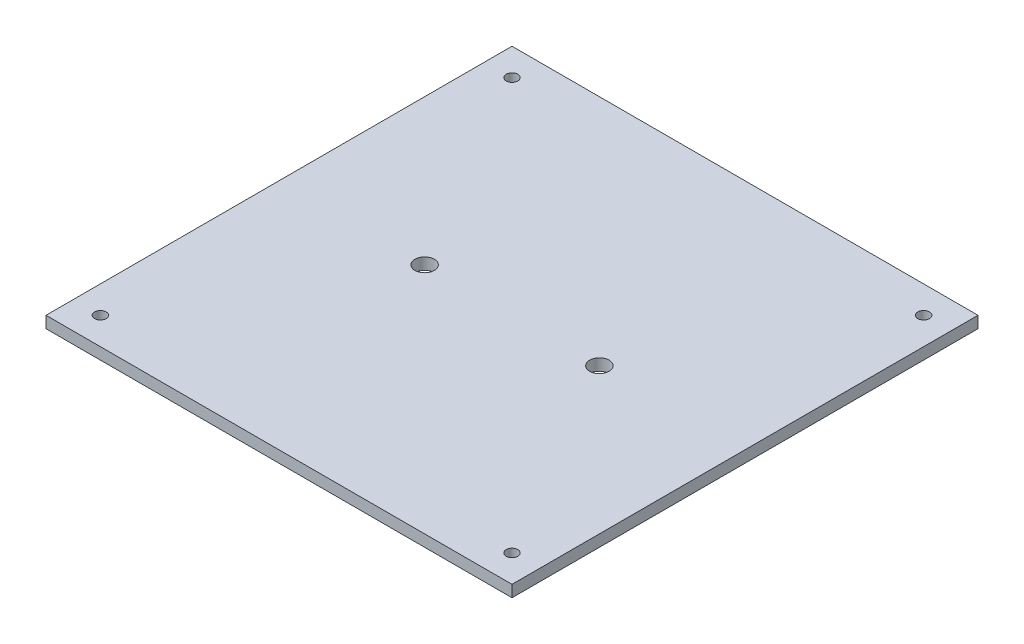
ISO-10303-21;
HEADER;
FILE_DESCRIPTION(('STEP AP214'),'2;1');
FILE_NAME('part.step','',(''),(''),'','','');
FILE_SCHEMA(('AUTOMOTIVE_DESIGN { 1 0 10303 214 1 1 1 1 }'));
ENDSEC;
DATA;
#1=APPLICATION_CONTEXT('core data for automotive mechanical design processes');
#2=APPLICATION_PROTOCOL_DEFINITION('international standard','automotive_design',2000,#1);
#3=PRODUCT_CONTEXT('',#1,'mechanical');
#4=PRODUCT('Part','Part','',(#3));
#5=PRODUCT_RELATED_PRODUCT_CATEGORY('part','',(#4));
#6=PRODUCT_DEFINITION_FORMATION('','',#4);
#7=PRODUCT_DEFINITION_CONTEXT('part definition',#1,'design');
#8=PRODUCT_DEFINITION('design','',#6,#7);
#9=PRODUCT_DEFINITION_SHAPE('','',#8);
#10=(LENGTH_UNIT() NAMED_UNIT(*) SI_UNIT(.MILLI.,.METRE.));
#11=(NAMED_UNIT(*) PLANE_ANGLE_UNIT() SI_UNIT($,.RADIAN.));
#12=(NAMED_UNIT(*) SI_UNIT($,.STERADIAN.) SOLID_ANGLE_UNIT());
#13=UNCERTAINTY_MEASURE_WITH_UNIT(LENGTH_MEASURE(1.E-05),#10,'distance_accuracy_value','');
#14=(GEOMETRIC_REPRESENTATION_CONTEXT(3) GLOBAL_UNCERTAINTY_ASSIGNED_CONTEXT((#13)) GLOBAL_UNIT_ASSIGNED_CONTEXT((#10,
#11,#12)) REPRESENTATION_CONTEXT('',''));
#15=CARTESIAN_POINT('',(0.,0.,0.));
#16=DIRECTION('',(0.,0.,1.));
#17=DIRECTION('',(1.,0.,0.));
#18=AXIS2_PLACEMENT_3D('',#15,#16,#17);
#19=CARTESIAN_POINT('',(60.,3.,60.));
#20=DIRECTION('',(-1.,0.,0.));
#21=DIRECTION('',(0.,0.,1.));
#22=AXIS2_PLACEMENT_3D('',#19,#20,#21);
#23=PLANE('',#22);
#24=DIRECTION('',(0.,0.,-1.));
#25=VECTOR('',#24,1.);
#26=CARTESIAN_POINT('',(60.,0.,60.));
#27=LINE('',#26,#25);
#28=CARTESIAN_POINT('',(60.,0.,60.));
#29=VERTEX_POINT('',#28);
#30=CARTESIAN_POINT('',(60.,0.,-60.));
#31=VERTEX_POINT('',#30);
#32=EDGE_CURVE('E96',#29,#31,#27,.T.);
#33=ORIENTED_EDGE('',*,*,#32,.T.);
#34=DIRECTION('',(0.,-1.,0.));
#35=VECTOR('',#34,1.);
#36=CARTESIAN_POINT('',(60.,3.,-60.));
#37=LINE('',#36,#35);
#38=CARTESIAN_POINT('',(60.,3.,-60.));
#39=VERTEX_POINT('',#38);
#40=EDGE_CURVE('E11',#39,#31,#37,.T.);
#41=ORIENTED_EDGE('',*,*,#40,.F.);
#42=DIRECTION('',(0.,0.,-1.));
#43=VECTOR('',#42,1.);
#44=CARTESIAN_POINT('',(60.,3.,60.));
#45=LINE('',#44,#43);
#46=CARTESIAN_POINT('',(60.,3.,60.));
#47=VERTEX_POINT('',#46);
#48=EDGE_CURVE('E84',#47,#39,#45,.T.);
#49=ORIENTED_EDGE('',*,*,#48,.F.);
#50=DIRECTION('',(0.,-1.,0.));
#51=VECTOR('',#50,1.);
#52=CARTESIAN_POINT('',(60.,3.,60.));
#53=LINE('',#52,#51);
#54=EDGE_CURVE('E92',#47,#29,#53,.T.);
#55=ORIENTED_EDGE('',*,*,#54,.T.);
#56=EDGE_LOOP('',(#33,#41,#49,#55));
#57=FACE_BOUND('',#56,.T.);
#58=ADVANCED_FACE('F33',(#57),#23,.F.);
#59=CARTESIAN_POINT('',(-60.,3.,-60.));
#60=DIRECTION('',(0.,0.,1.));
#61=DIRECTION('',(1.,0.,0.));
#62=AXIS2_PLACEMENT_3D('',#59,#60,#61);
#63=PLANE('',#62);
#64=DIRECTION('',(-1.,0.,0.));
#65=VECTOR('',#64,1.);
#66=CARTESIAN_POINT('',(-60.,0.,-60.));
#67=LINE('',#66,#65);
#68=CARTESIAN_POINT('',(-60.,0.,-60.));
#69=VERTEX_POINT('',#68);
#70=EDGE_CURVE('E88',#31,#69,#67,.T.);
#71=ORIENTED_EDGE('',*,*,#70,.T.);
#72=DIRECTION('',(0.,-1.,0.));
#73=VECTOR('',#72,1.);
#74=CARTESIAN_POINT('',(-60.,3.,-60.));
#75=LINE('',#74,#73);
#76=CARTESIAN_POINT('',(-60.,3.,-60.));
#77=VERTEX_POINT('',#76);
#78=EDGE_CURVE('E41',#77,#69,#75,.T.);
#79=ORIENTED_EDGE('',*,*,#78,.F.);
#80=DIRECTION('',(-1.,0.,0.));
#81=VECTOR('',#80,1.);
#82=CARTESIAN_POINT('',(-60.,3.,-60.));
#83=LINE('',#82,#81);
#84=EDGE_CURVE('E79',#39,#77,#83,.T.);
#85=ORIENTED_EDGE('',*,*,#84,.F.);
#86=ORIENTED_EDGE('',*,*,#40,.T.);
#87=EDGE_LOOP('',(#71,#79,#85,#86));
#88=FACE_BOUND('',#87,.T.);
#89=ADVANCED_FACE('F87',(#88),#63,.F.);
#90=CARTESIAN_POINT('',(-60.,3.,60.));
#91=DIRECTION('',(1.,0.,0.));
#92=DIRECTION('',(0.,0.,-1.));
#93=AXIS2_PLACEMENT_3D('',#90,#91,#92);
#94=PLANE('',#93);
#95=DIRECTION('',(0.,0.,1.));
#96=VECTOR('',#95,1.);
#97=CARTESIAN_POINT('',(-60.,0.,60.));
#98=LINE('',#97,#96);
#99=CARTESIAN_POINT('',(-60.,0.,60.));
#100=VERTEX_POINT('',#99);
#101=EDGE_CURVE('E66',#69,#100,#98,.T.);
#102=ORIENTED_EDGE('',*,*,#101,.T.);
#103=DIRECTION('',(0.,-1.,0.));
#104=VECTOR('',#103,1.);
#105=CARTESIAN_POINT('',(-60.,3.,60.));
#106=LINE('',#105,#104);
#107=CARTESIAN_POINT('',(-60.,3.,60.));
#108=VERTEX_POINT('',#107);
#109=EDGE_CURVE('E89',#108,#100,#106,.T.);
#110=ORIENTED_EDGE('',*,*,#109,.F.);
#111=DIRECTION('',(0.,0.,1.));
#112=VECTOR('',#111,1.);
#113=CARTESIAN_POINT('',(-60.,3.,60.));
#114=LINE('',#113,#112);
#115=EDGE_CURVE('E82',#77,#108,#114,.T.);
#116=ORIENTED_EDGE('',*,*,#115,.F.);
#117=ORIENTED_EDGE('',*,*,#78,.T.);
#118=EDGE_LOOP('',(#102,#110,#116,#117));
#119=FACE_BOUND('',#118,.T.);
#120=ADVANCED_FACE('F90',(#119),#94,.F.);
#121=CARTESIAN_POINT('',(-60.,3.,60.));
#122=DIRECTION('',(0.,0.,-1.));
#123=DIRECTION('',(-1.,0.,0.));
#124=AXIS2_PLACEMENT_3D('',#121,#122,#123);
#125=PLANE('',#124);
#126=DIRECTION('',(1.,0.,0.));
#127=VECTOR('',#126,1.);
#128=CARTESIAN_POINT('',(-60.,0.,60.));
#129=LINE('',#128,#127);
#130=EDGE_CURVE('E72',#100,#29,#129,.T.);
#131=ORIENTED_EDGE('',*,*,#130,.T.);
#132=ORIENTED_EDGE('',*,*,#54,.F.);
#133=DIRECTION('',(1.,0.,0.));
#134=VECTOR('',#133,1.);
#135=CARTESIAN_POINT('',(-60.,3.,60.));
#136=LINE('',#135,#134);
#137=EDGE_CURVE('E49',#108,#47,#136,.T.);
#138=ORIENTED_EDGE('',*,*,#137,.F.);
#139=ORIENTED_EDGE('',*,*,#109,.T.);
#140=EDGE_LOOP('',(#131,#132,#138,#139));
#141=FACE_BOUND('',#140,.T.);
#142=ADVANCED_FACE('F104',(#141),#125,.F.);
#143=CARTESIAN_POINT('',(0.,3.,0.));
#144=DIRECTION('',(0.,-1.,0.));
#145=DIRECTION('',(0.,0.,-1.));
#146=AXIS2_PLACEMENT_3D('',#143,#144,#145);
#147=PLANE('',#146);
#148=CARTESIAN_POINT('',(52.9999999999986,3.,-52.9999999999986));
#149=DIRECTION('',(0.,-1.,0.));
#150=DIRECTION('',(0.,0.,-1.));
#151=AXIS2_PLACEMENT_3D('',#148,#149,#150);
#152=CIRCLE('',#151,1.5);
#153=CARTESIAN_POINT('',(52.9999999999986,3.,-54.4999999999986));
#154=VERTEX_POINT('',#153);
#155=EDGE_CURVE('E127',#154,#154,#152,.T.);
#156=ORIENTED_EDGE('',*,*,#155,.T.);
#157=EDGE_LOOP('',(#156));
#158=FACE_BOUND('',#157,.T.);
#159=CARTESIAN_POINT('',(-52.9999999999702,3.,53.0000000000271));
#160=DIRECTION('',(0.,-1.,0.));
#161=DIRECTION('',(0.,0.,-1.));
#162=AXIS2_PLACEMENT_3D('',#159,#160,#161);
#163=CIRCLE('',#162,1.5);
#164=CARTESIAN_POINT('',(-52.9999999999702,3.,51.5000000000271));
#165=VERTEX_POINT('',#164);
#166=EDGE_CURVE('E128',#165,#165,#163,.T.);
#167=ORIENTED_EDGE('',*,*,#166,.T.);
#168=EDGE_LOOP('',(#167));
#169=FACE_BOUND('',#168,.T.);
#170=CARTESIAN_POINT('',(52.9999999999986,3.,52.9999999999986));
#171=DIRECTION('',(0.,-1.,0.));
#172=DIRECTION('',(0.,0.,-1.));
#173=AXIS2_PLACEMENT_3D('',#170,#171,#172);
#174=CIRCLE('',#173,1.5);
#175=CARTESIAN_POINT('',(52.9999999999986,3.,51.4999999999986));
#176=VERTEX_POINT('',#175);
#177=EDGE_CURVE('E135',#176,#176,#174,.T.);
#178=ORIENTED_EDGE('',*,*,#177,.T.);
#179=EDGE_LOOP('',(#178));
#180=FACE_BOUND('',#179,.T.);
#181=CARTESIAN_POINT('',(-52.9999999999986,3.,-52.9999999999986));
#182=DIRECTION('',(0.,-1.,0.));
#183=DIRECTION('',(0.,0.,-1.));
#184=AXIS2_PLACEMENT_3D('',#181,#182,#183);
#185=CIRCLE('',#184,1.5);
#186=CARTESIAN_POINT('',(-52.9999999999986,3.,-54.4999999999986));
#187=VERTEX_POINT('',#186);
#188=EDGE_CURVE('E117',#187,#187,#185,.T.);
#189=ORIENTED_EDGE('',*,*,#188,.T.);
#190=EDGE_LOOP('',(#189));
#191=FACE_BOUND('',#190,.T.);
#192=CARTESIAN_POINT('',(-22.500000000004,3.,0.));
#193=DIRECTION('',(0.,-1.,0.));
#194=DIRECTION('',(0.,0.,-1.));
#195=AXIS2_PLACEMENT_3D('',#192,#193,#194);
#196=CIRCLE('',#195,2.5);
#197=CARTESIAN_POINT('',(-22.500000000004,3.,-2.5));
#198=VERTEX_POINT('',#197);
#199=EDGE_CURVE('E99',#198,#198,#196,.T.);
#200=ORIENTED_EDGE('',*,*,#199,.T.);
#201=EDGE_LOOP('',(#200));
#202=FACE_BOUND('',#201,.T.);
#203=CARTESIAN_POINT('',(22.500000000004,3.,0.));
#204=DIRECTION('',(0.,-1.,0.));
#205=DIRECTION('',(0.,0.,-1.));
#206=AXIS2_PLACEMENT_3D('',#203,#204,#205);
#207=CIRCLE('',#206,2.5);
#208=CARTESIAN_POINT('',(22.500000000004,3.,-2.5));
#209=VERTEX_POINT('',#208);
#210=EDGE_CURVE('E110',#209,#209,#207,.T.);
#211=ORIENTED_EDGE('',*,*,#210,.T.);
#212=EDGE_LOOP('',(#211));
#213=FACE_BOUND('',#212,.T.);
#214=ORIENTED_EDGE('',*,*,#48,.T.);
#215=ORIENTED_EDGE('',*,*,#84,.T.);
#216=ORIENTED_EDGE('',*,*,#115,.T.);
#217=ORIENTED_EDGE('',*,*,#137,.T.);
#218=EDGE_LOOP('',(#214,#215,#216,#217));
#219=FACE_BOUND('',#218,.T.);
#220=ADVANCED_FACE('F80',(#158,#169,#180,#191,#202,#213,#219),#147,.F.);
#221=CARTESIAN_POINT('',(0.,0.,0.));
#222=DIRECTION('',(0.,-1.,0.));
#223=DIRECTION('',(0.,0.,-1.));
#224=AXIS2_PLACEMENT_3D('',#221,#222,#223);
#225=PLANE('',#224);
#226=CARTESIAN_POINT('',(52.9999999999986,0.,-52.9999999999986));
#227=DIRECTION('',(0.,1.,0.));
#228=DIRECTION('',(0.,0.,1.));
#229=AXIS2_PLACEMENT_3D('',#226,#227,#228);
#230=CIRCLE('',#229,1.5);
#231=CARTESIAN_POINT('',(52.9999999999986,0.,-51.4999999999986));
#232=VERTEX_POINT('',#231);
#233=EDGE_CURVE('E131',#232,#232,#230,.T.);
#234=ORIENTED_EDGE('',*,*,#233,.T.);
#235=EDGE_LOOP('',(#234));
#236=FACE_BOUND('',#235,.T.);
#237=CARTESIAN_POINT('',(-52.9999999999702,0.,53.0000000000271));
#238=DIRECTION('',(0.,1.,0.));
#239=DIRECTION('',(0.,0.,1.));
#240=AXIS2_PLACEMENT_3D('',#237,#238,#239);
#241=CIRCLE('',#240,1.5);
#242=CARTESIAN_POINT('',(-52.9999999999702,0.,54.5000000000271));
#243=VERTEX_POINT('',#242);
#244=EDGE_CURVE('E132',#243,#243,#241,.T.);
#245=ORIENTED_EDGE('',*,*,#244,.T.);
#246=EDGE_LOOP('',(#245));
#247=FACE_BOUND('',#246,.T.);
#248=CARTESIAN_POINT('',(52.9999999999986,0.,52.9999999999986));
#249=DIRECTION('',(0.,1.,0.));
#250=DIRECTION('',(0.,0.,1.));
#251=AXIS2_PLACEMENT_3D('',#248,#249,#250);
#252=CIRCLE('',#251,1.5);
#253=CARTESIAN_POINT('',(52.9999999999986,0.,54.4999999999986));
#254=VERTEX_POINT('',#253);
#255=EDGE_CURVE('E142',#254,#254,#252,.T.);
#256=ORIENTED_EDGE('',*,*,#255,.T.);
#257=EDGE_LOOP('',(#256));
#258=FACE_BOUND('',#257,.T.);
#259=CARTESIAN_POINT('',(-52.9999999999986,0.,-52.9999999999986));
#260=DIRECTION('',(0.,1.,0.));
#261=DIRECTION('',(0.,0.,1.));
#262=AXIS2_PLACEMENT_3D('',#259,#260,#261);
#263=CIRCLE('',#262,1.5);
#264=CARTESIAN_POINT('',(-52.9999999999986,0.,-51.4999999999986));
#265=VERTEX_POINT('',#264);
#266=EDGE_CURVE('E124',#265,#265,#263,.T.);
#267=ORIENTED_EDGE('',*,*,#266,.T.);
#268=EDGE_LOOP('',(#267));
#269=FACE_BOUND('',#268,.T.);
#270=CARTESIAN_POINT('',(-22.500000000004,0.,0.));
#271=DIRECTION('',(0.,1.,0.));
#272=DIRECTION('',(0.,0.,1.));
#273=AXIS2_PLACEMENT_3D('',#270,#271,#272);
#274=CIRCLE('',#273,2.5);
#275=CARTESIAN_POINT('',(-22.500000000004,0.,2.5));
#276=VERTEX_POINT('',#275);
#277=EDGE_CURVE('E113',#276,#276,#274,.T.);
#278=ORIENTED_EDGE('',*,*,#277,.T.);
#279=EDGE_LOOP('',(#278));
#280=FACE_BOUND('',#279,.T.);
#281=CARTESIAN_POINT('',(22.500000000004,0.,0.));
#282=DIRECTION('',(0.,1.,0.));
#283=DIRECTION('',(0.,0.,1.));
#284=AXIS2_PLACEMENT_3D('',#281,#282,#283);
#285=CIRCLE('',#284,2.5);
#286=CARTESIAN_POINT('',(22.500000000004,0.,2.5));
#287=VERTEX_POINT('',#286);
#288=EDGE_CURVE('E114',#287,#287,#285,.T.);
#289=ORIENTED_EDGE('',*,*,#288,.T.);
#290=EDGE_LOOP('',(#289));
#291=FACE_BOUND('',#290,.T.);
#292=ORIENTED_EDGE('',*,*,#32,.F.);
#293=ORIENTED_EDGE('',*,*,#130,.F.);
#294=ORIENTED_EDGE('',*,*,#101,.F.);
#295=ORIENTED_EDGE('',*,*,#70,.F.);
#296=EDGE_LOOP('',(#292,#293,#294,#295));
#297=FACE_BOUND('',#296,.T.);
#298=ADVANCED_FACE('F107',(#236,#247,#258,#269,#280,#291,#297),#225,.T.);
#299=CARTESIAN_POINT('',(22.500000000004,10.0710678118655,0.));
#300=DIRECTION('',(0.,-1.,0.));
#301=DIRECTION('',(0.,0.,-1.));
#302=AXIS2_PLACEMENT_3D('',#299,#300,#301);
#303=CYLINDRICAL_SURFACE('',#302,2.5);
#304=ORIENTED_EDGE('',*,*,#210,.F.);
#305=EDGE_LOOP('',(#304));
#306=FACE_BOUND('',#305,.T.);
#307=ORIENTED_EDGE('',*,*,#288,.F.);
#308=EDGE_LOOP('',(#307));
#309=FACE_BOUND('',#308,.T.);
#310=ADVANCED_FACE('F179',(#306,#309),#303,.F.);
#311=CARTESIAN_POINT('',(-22.500000000004,10.0710678118655,0.));
#312=DIRECTION('',(0.,-1.,0.));
#313=DIRECTION('',(0.,0.,-1.));
#314=AXIS2_PLACEMENT_3D('',#311,#312,#313);
#315=CYLINDRICAL_SURFACE('',#314,2.5);
#316=ORIENTED_EDGE('',*,*,#199,.F.);
#317=EDGE_LOOP('',(#316));
#318=FACE_BOUND('',#317,.T.);
#319=ORIENTED_EDGE('',*,*,#277,.F.);
#320=EDGE_LOOP('',(#319));
#321=FACE_BOUND('',#320,.T.);
#322=ADVANCED_FACE('F161',(#318,#321),#315,.F.);
#323=CARTESIAN_POINT('',(-52.9999999999986,7.24264068711929,-52.9999999999986));
#324=DIRECTION('',(0.,-1.,0.));
#325=DIRECTION('',(0.,0.,-1.));
#326=AXIS2_PLACEMENT_3D('',#323,#324,#325);
#327=CYLINDRICAL_SURFACE('',#326,1.5);
#328=ORIENTED_EDGE('',*,*,#188,.F.);
#329=EDGE_LOOP('',(#328));
#330=FACE_BOUND('',#329,.T.);
#331=ORIENTED_EDGE('',*,*,#266,.F.);
#332=EDGE_LOOP('',(#331));
#333=FACE_BOUND('',#332,.T.);
#334=ADVANCED_FACE('F151',(#330,#333),#327,.F.);
#335=CARTESIAN_POINT('',(52.9999999999986,7.24264068711929,52.9999999999986));
#336=DIRECTION('',(0.,-1.,0.));
#337=DIRECTION('',(0.,0.,-1.));
#338=AXIS2_PLACEMENT_3D('',#335,#336,#337);
#339=CYLINDRICAL_SURFACE('',#338,1.5);
#340=ORIENTED_EDGE('',*,*,#177,.F.);
#341=EDGE_LOOP('',(#340));
#342=FACE_BOUND('',#341,.T.);
#343=ORIENTED_EDGE('',*,*,#255,.F.);
#344=EDGE_LOOP('',(#343));
#345=FACE_BOUND('',#344,.T.);
#346=ADVANCED_FACE('F148',(#342,#345),#339,.F.);
#347=CARTESIAN_POINT('',(-52.9999999999702,7.24264068711929,53.0000000000271));
#348=DIRECTION('',(0.,-1.,0.));
#349=DIRECTION('',(0.,0.,-1.));
#350=AXIS2_PLACEMENT_3D('',#347,#348,#349);
#351=CYLINDRICAL_SURFACE('',#350,1.5);
#352=ORIENTED_EDGE('',*,*,#166,.F.);
#353=EDGE_LOOP('',(#352));
#354=FACE_BOUND('',#353,.T.);
#355=ORIENTED_EDGE('',*,*,#244,.F.);
#356=EDGE_LOOP('',(#355));
#357=FACE_BOUND('',#356,.T.);
#358=ADVANCED_FACE('F150',(#354,#357),#351,.F.);
#359=CARTESIAN_POINT('',(52.9999999999986,7.24264068711929,-52.9999999999986));
#360=DIRECTION('',(0.,-1.,0.));
#361=DIRECTION('',(0.,0.,-1.));
#362=AXIS2_PLACEMENT_3D('',#359,#360,#361);
#363=CYLINDRICAL_SURFACE('',#362,1.5);
#364=ORIENTED_EDGE('',*,*,#155,.F.);
#365=EDGE_LOOP('',(#364));
#366=FACE_BOUND('',#365,.T.);
#367=ORIENTED_EDGE('',*,*,#233,.F.);
#368=EDGE_LOOP('',(#367));
#369=FACE_BOUND('',#368,.T.);
#370=ADVANCED_FACE('F158',(#366,#369),#363,.F.);
#371=CLOSED_SHELL('',(#58,#89,#120,#142,#220,#298,#310,#322,#334,#346,#358,#370));
#372=MANIFOLD_SOLID_BREP('B2',#371);
#373=ADVANCED_BREP_SHAPE_REPRESENTATION('',(#18,#372),#14);
#374=SHAPE_DEFINITION_REPRESENTATION(#9,#373);
ENDSEC;
END-ISO-10303-21;
